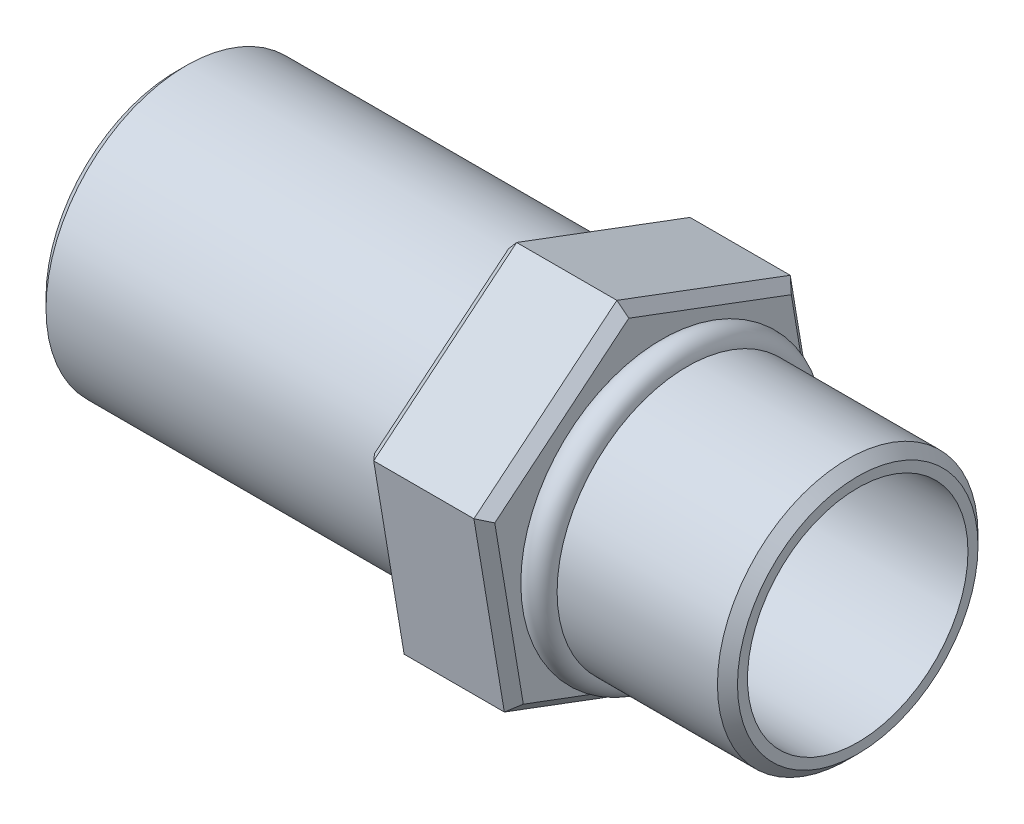
ISO-10303-21;
HEADER;
FILE_DESCRIPTION(('STEP AP214'),'2;1');
FILE_NAME('part.step','',(''),(''),'','','');
FILE_SCHEMA(('AUTOMOTIVE_DESIGN { 1 0 10303 214 1 1 1 1 }'));
ENDSEC;
DATA;
#1=APPLICATION_CONTEXT('core data for automotive mechanical design processes');
#2=APPLICATION_PROTOCOL_DEFINITION('international standard','automotive_design',2000,#1);
#3=PRODUCT_CONTEXT('',#1,'mechanical');
#4=PRODUCT('Part','Part','',(#3));
#5=PRODUCT_RELATED_PRODUCT_CATEGORY('part','',(#4));
#6=PRODUCT_DEFINITION_FORMATION('','',#4);
#7=PRODUCT_DEFINITION_CONTEXT('part definition',#1,'design');
#8=PRODUCT_DEFINITION('design','',#6,#7);
#9=PRODUCT_DEFINITION_SHAPE('','',#8);
#10=(LENGTH_UNIT() NAMED_UNIT(*) SI_UNIT(.MILLI.,.METRE.));
#11=(NAMED_UNIT(*) PLANE_ANGLE_UNIT() SI_UNIT($,.RADIAN.));
#12=(NAMED_UNIT(*) SI_UNIT($,.STERADIAN.) SOLID_ANGLE_UNIT());
#13=UNCERTAINTY_MEASURE_WITH_UNIT(LENGTH_MEASURE(1.E-05),#10,'distance_accuracy_value','');
#14=(GEOMETRIC_REPRESENTATION_CONTEXT(3) GLOBAL_UNCERTAINTY_ASSIGNED_CONTEXT((#13)) GLOBAL_UNIT_ASSIGNED_CONTEXT((#10,
#11,#12)) REPRESENTATION_CONTEXT('',''));
#15=CARTESIAN_POINT('',(0.,0.,0.));
#16=DIRECTION('',(0.,0.,1.));
#17=DIRECTION('',(1.,0.,0.));
#18=AXIS2_PLACEMENT_3D('',#15,#16,#17);
#19=CARTESIAN_POINT('',(10.,0.,0.));
#20=DIRECTION('',(-1.,0.,0.));
#21=DIRECTION('',(0.,0.,1.));
#22=AXIS2_PLACEMENT_3D('',#19,#20,#21);
#23=CYLINDRICAL_SURFACE('',#22,6.5);
#24=CARTESIAN_POINT('',(9.49999999999999,0.,0.));
#25=DIRECTION('',(1.,0.,0.));
#26=DIRECTION('',(0.,0.,-1.));
#27=AXIS2_PLACEMENT_3D('',#24,#25,#26);
#28=CIRCLE('',#27,6.5);
#29=CARTESIAN_POINT('',(9.49999999999999,0.,-6.5));
#30=VERTEX_POINT('',#29);
#31=EDGE_CURVE('E243',#30,#30,#28,.F.);
#32=ORIENTED_EDGE('',*,*,#31,.T.);
#33=EDGE_LOOP('',(#32));
#34=FACE_BOUND('',#33,.T.);
#35=CARTESIAN_POINT('',(1.5,0.,0.));
#36=DIRECTION('',(1.,0.,0.));
#37=DIRECTION('',(0.,0.,-1.));
#38=AXIS2_PLACEMENT_3D('',#35,#36,#37);
#39=CIRCLE('',#38,6.5);
#40=CARTESIAN_POINT('',(1.5,0.,-6.5));
#41=VERTEX_POINT('',#40);
#42=EDGE_CURVE('E158',#41,#41,#39,.T.);
#43=ORIENTED_EDGE('',*,*,#42,.T.);
#44=EDGE_LOOP('',(#43));
#45=FACE_BOUND('',#44,.T.);
#46=ADVANCED_FACE('F34',(#34,#45),#23,.T.);
#47=CARTESIAN_POINT('',(10.,0.,0.));
#48=DIRECTION('',(1.,0.,0.));
#49=DIRECTION('',(0.,0.,-1.));
#50=AXIS2_PLACEMENT_3D('',#47,#48,#49);
#51=PLANE('',#50);
#52=CARTESIAN_POINT('',(10.,0.,0.));
#53=DIRECTION('',(1.,0.,0.));
#54=DIRECTION('',(0.,0.,-1.));
#55=AXIS2_PLACEMENT_3D('',#52,#53,#54);
#56=CIRCLE('',#55,5.99999999999999);
#57=CARTESIAN_POINT('',(10.,0.,-5.99999999999999));
#58=VERTEX_POINT('',#57);
#59=EDGE_CURVE('E219',#58,#58,#56,.T.);
#60=ORIENTED_EDGE('',*,*,#59,.T.);
#61=EDGE_LOOP('',(#60));
#62=FACE_BOUND('',#61,.T.);
#63=CARTESIAN_POINT('',(10.,0.,0.));
#64=DIRECTION('',(1.,0.,0.));
#65=DIRECTION('',(0.,0.,-1.));
#66=AXIS2_PLACEMENT_3D('',#63,#64,#65);
#67=CIRCLE('',#66,5.5);
#68=CARTESIAN_POINT('',(10.,0.,-5.5));
#69=VERTEX_POINT('',#68);
#70=EDGE_CURVE('E240',#69,#69,#67,.T.);
#71=ORIENTED_EDGE('',*,*,#70,.F.);
#72=EDGE_LOOP('',(#71));
#73=FACE_BOUND('',#72,.T.);
#74=ADVANCED_FACE('F283',(#62,#73),#51,.T.);
#75=CARTESIAN_POINT('',(0.75,0.,0.));
#76=DIRECTION('',(1.,0.,0.));
#77=DIRECTION('',(0.,0.,-1.));
#78=AXIS2_PLACEMENT_3D('',#75,#76,#77);
#79=TOROIDAL_SURFACE('',#78,6.5,0.75);
#80=CARTESIAN_POINT('',(0.,0.,0.));
#81=DIRECTION('',(1.,0.,0.));
#82=DIRECTION('',(0.,0.,-1.));
#83=AXIS2_PLACEMENT_3D('',#80,#81,#82);
#84=CIRCLE('',#83,6.5);
#85=CARTESIAN_POINT('',(0.,0.,-6.5));
#86=VERTEX_POINT('',#85);
#87=EDGE_CURVE('E161',#86,#86,#84,.F.);
#88=ORIENTED_EDGE('',*,*,#87,.F.);
#89=EDGE_LOOP('',(#88));
#90=FACE_BOUND('',#89,.T.);
#91=ORIENTED_EDGE('',*,*,#42,.F.);
#92=EDGE_LOOP('',(#91));
#93=FACE_BOUND('',#92,.T.);
#94=ADVANCED_FACE('F289',(#90,#93),#79,.T.);
#95=CARTESIAN_POINT('',(-6.,-9.11201705266674,-1.51805090996447));
#96=DIRECTION('',(0.,0.936418514454213,-0.350885117648731));
#97=DIRECTION('',(0.,0.350885117648731,0.936418514454214));
#98=AXIS2_PLACEMENT_3D('',#95,#96,#97);
#99=PLANE('',#98);
#100=DIRECTION('',(1.,0.,0.));
#101=VECTOR('',#100,1.);
#102=CARTESIAN_POINT('',(-6.,-9.11201705266674,-1.51805090996447));
#103=LINE('',#102,#101);
#104=CARTESIAN_POINT('',(-5.5,-9.11201705266674,-1.51805090996447));
#105=VERTEX_POINT('',#104);
#106=CARTESIAN_POINT('',(-0.499999999999997,-9.11201705266674,-1.51805090996447));
#107=VERTEX_POINT('',#106);
#108=EDGE_CURVE('E195',#105,#107,#103,.T.);
#109=ORIENTED_EDGE('',*,*,#108,.T.);
#110=DIRECTION('',(0.,0.350885117648731,0.936418514454214));
#111=VECTOR('',#110,1.);
#112=CARTESIAN_POINT('',(-0.499999999999997,-9.11201705266674,-1.51805090996447));
#113=LINE('',#112,#111);
#114=CARTESIAN_POINT('',(-0.499999999999997,-5.87067917860069,7.13221279234417));
#115=VERTEX_POINT('',#114);
#116=EDGE_CURVE('E215',#107,#115,#113,.T.);
#117=ORIENTED_EDGE('',*,*,#116,.T.);
#118=DIRECTION('',(1.,0.,0.));
#119=VECTOR('',#118,1.);
#120=CARTESIAN_POINT('',(-6.,-5.87067917860069,7.13221279234417));
#121=LINE('',#120,#119);
#122=CARTESIAN_POINT('',(-5.5,-5.87067917860069,7.13221279234417));
#123=VERTEX_POINT('',#122);
#124=EDGE_CURVE('E374',#123,#115,#121,.T.);
#125=ORIENTED_EDGE('',*,*,#124,.F.);
#126=DIRECTION('',(0.,-0.350885117648731,-0.936418514454214));
#127=VECTOR('',#126,1.);
#128=CARTESIAN_POINT('',(-5.5,-9.11201705266674,-1.51805090996447));
#129=LINE('',#128,#127);
#130=EDGE_CURVE('E182',#123,#105,#129,.T.);
#131=ORIENTED_EDGE('',*,*,#130,.T.);
#132=EDGE_LOOP('',(#109,#117,#125,#131));
#133=FACE_BOUND('',#132,.T.);
#134=ADVANCED_FACE('F383',(#133),#99,.F.);
#135=CARTESIAN_POINT('',(-6.,-5.87067917860069,7.13221279234417));
#136=DIRECTION('',(0.,0.164333831533414,-0.9864047809158));
#137=DIRECTION('',(0.,0.9864047809158,0.164333831533414));
#138=AXIS2_PLACEMENT_3D('',#135,#136,#137);
#139=PLANE('',#138);
#140=ORIENTED_EDGE('',*,*,#124,.T.);
#141=DIRECTION('',(0.,0.9864047809158,0.164333831533414));
#142=VECTOR('',#141,1.);
#143=CARTESIAN_POINT('',(-0.499999999999997,-5.87067917860069,7.13221279234417));
#144=LINE('',#143,#142);
#145=CARTESIAN_POINT('',(-0.499999999999997,3.24133787406605,8.65026370230864));
#146=VERTEX_POINT('',#145);
#147=EDGE_CURVE('E213',#115,#146,#144,.T.);
#148=ORIENTED_EDGE('',*,*,#147,.T.);
#149=DIRECTION('',(1.,0.,0.));
#150=VECTOR('',#149,1.);
#151=CARTESIAN_POINT('',(-6.,3.24133787406605,8.65026370230864));
#152=LINE('',#151,#150);
#153=CARTESIAN_POINT('',(-5.5,3.24133787406605,8.65026370230864));
#154=VERTEX_POINT('',#153);
#155=EDGE_CURVE('E371',#154,#146,#152,.T.);
#156=ORIENTED_EDGE('',*,*,#155,.F.);
#157=DIRECTION('',(0.,-0.9864047809158,-0.164333831533414));
#158=VECTOR('',#157,1.);
#159=CARTESIAN_POINT('',(-5.5,-5.87067917860069,7.13221279234417));
#160=LINE('',#159,#158);
#161=EDGE_CURVE('E172',#154,#123,#160,.T.);
#162=ORIENTED_EDGE('',*,*,#161,.T.);
#163=EDGE_LOOP('',(#140,#148,#156,#162));
#164=FACE_BOUND('',#163,.T.);
#165=ADVANCED_FACE('F388',(#164),#139,.F.);
#166=CARTESIAN_POINT('',(-6.,3.24133787406605,8.65026370230864));
#167=DIRECTION('',(0.,-0.772084682920799,-0.635519663267069));
#168=DIRECTION('',(0.,0.635519663267069,-0.772084682920799));
#169=AXIS2_PLACEMENT_3D('',#166,#167,#168);
#170=PLANE('',#169);
#171=ORIENTED_EDGE('',*,*,#155,.T.);
#172=DIRECTION('',(0.,0.635519663267069,-0.772084682920799));
#173=VECTOR('',#172,1.);
#174=CARTESIAN_POINT('',(-0.499999999999997,3.24133787406605,8.65026370230864));
#175=LINE('',#174,#173);
#176=CARTESIAN_POINT('',(-0.499999999999997,9.11201705266674,1.51805090996447));
#177=VERTEX_POINT('',#176);
#178=EDGE_CURVE('E211',#146,#177,#175,.T.);
#179=ORIENTED_EDGE('',*,*,#178,.T.);
#180=DIRECTION('',(1.,0.,0.));
#181=VECTOR('',#180,1.);
#182=CARTESIAN_POINT('',(-6.,9.11201705266674,1.51805090996447));
#183=LINE('',#182,#181);
#184=CARTESIAN_POINT('',(-5.5,9.11201705266674,1.51805090996447));
#185=VERTEX_POINT('',#184);
#186=EDGE_CURVE('E368',#185,#177,#183,.T.);
#187=ORIENTED_EDGE('',*,*,#186,.F.);
#188=DIRECTION('',(0.,-0.635519663267069,0.772084682920799));
#189=VECTOR('',#188,1.);
#190=CARTESIAN_POINT('',(-5.5,3.24133787406605,8.65026370230864));
#191=LINE('',#190,#189);
#192=EDGE_CURVE('E175',#185,#154,#191,.T.);
#193=ORIENTED_EDGE('',*,*,#192,.T.);
#194=EDGE_LOOP('',(#171,#179,#187,#193));
#195=FACE_BOUND('',#194,.T.);
#196=ADVANCED_FACE('F394',(#195),#170,.F.);
#197=CARTESIAN_POINT('',(-6.,9.11201705266674,1.51805090996447));
#198=DIRECTION('',(0.,-0.936418514454214,0.350885117648731));
#199=DIRECTION('',(0.,-0.350885117648731,-0.936418514454214));
#200=AXIS2_PLACEMENT_3D('',#197,#198,#199);
#201=PLANE('',#200);
#202=ORIENTED_EDGE('',*,*,#186,.T.);
#203=DIRECTION('',(0.,-0.350885117648731,-0.936418514454214));
#204=VECTOR('',#203,1.);
#205=CARTESIAN_POINT('',(-0.499999999999997,9.11201705266674,1.51805090996447));
#206=LINE('',#205,#204);
#207=CARTESIAN_POINT('',(-0.499999999999997,5.87067917860068,-7.13221279234416));
#208=VERTEX_POINT('',#207);
#209=EDGE_CURVE('E184',#177,#208,#206,.T.);
#210=ORIENTED_EDGE('',*,*,#209,.T.);
#211=DIRECTION('',(1.,0.,0.));
#212=VECTOR('',#211,1.);
#213=CARTESIAN_POINT('',(-6.,5.87067917860068,-7.13221279234416));
#214=LINE('',#213,#212);
#215=CARTESIAN_POINT('',(-5.5,5.87067917860068,-7.13221279234416));
#216=VERTEX_POINT('',#215);
#217=EDGE_CURVE('E366',#216,#208,#214,.T.);
#218=ORIENTED_EDGE('',*,*,#217,.F.);
#219=DIRECTION('',(0.,0.350885117648731,0.936418514454214));
#220=VECTOR('',#219,1.);
#221=CARTESIAN_POINT('',(-5.5,9.11201705266674,1.51805090996447));
#222=LINE('',#221,#220);
#223=EDGE_CURVE('E177',#216,#185,#222,.T.);
#224=ORIENTED_EDGE('',*,*,#223,.T.);
#225=EDGE_LOOP('',(#202,#210,#218,#224));
#226=FACE_BOUND('',#225,.T.);
#227=ADVANCED_FACE('F398',(#226),#201,.F.);
#228=CARTESIAN_POINT('',(-6.,5.87067917860068,-7.13221279234416));
#229=DIRECTION('',(0.,-0.164333831533414,0.9864047809158));
#230=DIRECTION('',(0.,-0.9864047809158,-0.164333831533414));
#231=AXIS2_PLACEMENT_3D('',#228,#229,#230);
#232=PLANE('',#231);
#233=ORIENTED_EDGE('',*,*,#217,.T.);
#234=DIRECTION('',(0.,-0.9864047809158,-0.164333831533414));
#235=VECTOR('',#234,1.);
#236=CARTESIAN_POINT('',(-0.499999999999997,5.87067917860068,-7.13221279234416));
#237=LINE('',#236,#235);
#238=CARTESIAN_POINT('',(-0.499999999999997,-3.24133787406605,-8.65026370230864));
#239=VERTEX_POINT('',#238);
#240=EDGE_CURVE('E56',#208,#239,#237,.T.);
#241=ORIENTED_EDGE('',*,*,#240,.T.);
#242=DIRECTION('',(1.,0.,0.));
#243=VECTOR('',#242,1.);
#244=CARTESIAN_POINT('',(-6.,-3.24133787406605,-8.65026370230864));
#245=LINE('',#244,#243);
#246=CARTESIAN_POINT('',(-5.5,-3.24133787406605,-8.65026370230864));
#247=VERTEX_POINT('',#246);
#248=EDGE_CURVE('E364',#247,#239,#245,.T.);
#249=ORIENTED_EDGE('',*,*,#248,.F.);
#250=DIRECTION('',(0.,0.9864047809158,0.164333831533414));
#251=VECTOR('',#250,1.);
#252=CARTESIAN_POINT('',(-5.5,5.87067917860068,-7.13221279234416));
#253=LINE('',#252,#251);
#254=EDGE_CURVE('E179',#247,#216,#253,.T.);
#255=ORIENTED_EDGE('',*,*,#254,.T.);
#256=EDGE_LOOP('',(#233,#241,#249,#255));
#257=FACE_BOUND('',#256,.T.);
#258=ADVANCED_FACE('F402',(#257),#232,.F.);
#259=CARTESIAN_POINT('',(-6.,-3.24133787406605,-8.65026370230864));
#260=DIRECTION('',(0.,0.772084682920799,0.635519663267069));
#261=DIRECTION('',(0.,-0.635519663267069,0.772084682920799));
#262=AXIS2_PLACEMENT_3D('',#259,#260,#261);
#263=PLANE('',#262);
#264=ORIENTED_EDGE('',*,*,#248,.T.);
#265=DIRECTION('',(0.,-0.635519663267069,0.772084682920799));
#266=VECTOR('',#265,1.);
#267=CARTESIAN_POINT('',(-0.499999999999997,-3.24133787406605,-8.65026370230864));
#268=LINE('',#267,#266);
#269=EDGE_CURVE('E63',#239,#107,#268,.T.);
#270=ORIENTED_EDGE('',*,*,#269,.T.);
#271=ORIENTED_EDGE('',*,*,#108,.F.);
#272=DIRECTION('',(0.,0.635519663267069,-0.772084682920799));
#273=VECTOR('',#272,1.);
#274=CARTESIAN_POINT('',(-5.5,-3.24133787406605,-8.65026370230864));
#275=LINE('',#274,#273);
#276=EDGE_CURVE('E149',#105,#247,#275,.T.);
#277=ORIENTED_EDGE('',*,*,#276,.T.);
#278=EDGE_LOOP('',(#264,#270,#271,#277));
#279=FACE_BOUND('',#278,.T.);
#280=ADVANCED_FACE('F406',(#279),#263,.F.);
#281=CARTESIAN_POINT('',(-6.,0.,0.));
#282=DIRECTION('',(-1.,0.,0.));
#283=DIRECTION('',(0.,0.,1.));
#284=AXIS2_PLACEMENT_3D('',#281,#282,#283);
#285=PLANE('',#284);
#286=CARTESIAN_POINT('',(-6.,0.,0.));
#287=DIRECTION('',(-1.,0.,0.));
#288=DIRECTION('',(0.,0.,1.));
#289=AXIS2_PLACEMENT_3D('',#286,#287,#288);
#290=CIRCLE('',#289,7.1);
#291=CARTESIAN_POINT('',(-6.,0.,7.1));
#292=VERTEX_POINT('',#291);
#293=EDGE_CURVE('E11',#292,#292,#290,.F.);
#294=ORIENTED_EDGE('',*,*,#293,.T.);
#295=EDGE_LOOP('',(#294));
#296=FACE_BOUND('',#295,.T.);
#297=DIRECTION('',(0.,0.350885117648731,0.936418514454214));
#298=VECTOR('',#297,1.);
#299=CARTESIAN_POINT('',(-6.,-5.40246992137358,6.9567702335198));
#300=LINE('',#299,#298);
#301=CARTESIAN_POINT('',(-6.,-8.54251598687507,-1.42317272809169));
#302=VERTEX_POINT('',#301);
#303=CARTESIAN_POINT('',(-6.,-5.50376172993814,6.68644949282266));
#304=VERTEX_POINT('',#303);
#305=EDGE_CURVE('E137',#302,#304,#300,.T.);
#306=ORIENTED_EDGE('',*,*,#305,.T.);
#307=DIRECTION('',(0.,0.9864047809158,0.164333831533414));
#308=VECTOR('',#307,1.);
#309=CARTESIAN_POINT('',(-6.,3.32350478983276,8.15706131185074));
#310=LINE('',#309,#308);
#311=CARTESIAN_POINT('',(-6.,3.03875425693693,8.10962222091435));
#312=VERTEX_POINT('',#311);
#313=EDGE_CURVE('E170',#304,#312,#310,.T.);
#314=ORIENTED_EDGE('',*,*,#313,.T.);
#315=DIRECTION('',(0.,0.635519663267069,-0.772084682920799));
#316=VECTOR('',#315,1.);
#317=CARTESIAN_POINT('',(-6.,8.72597471120634,1.20029107833094));
#318=LINE('',#317,#316);
#319=CARTESIAN_POINT('',(-6.,8.54251598687507,1.42317272809169));
#320=VERTEX_POINT('',#319);
#321=EDGE_CURVE('E168',#312,#320,#318,.T.);
#322=ORIENTED_EDGE('',*,*,#321,.T.);
#323=DIRECTION('',(0.,-0.350885117648731,-0.936418514454214));
#324=VECTOR('',#323,1.);
#325=CARTESIAN_POINT('',(-6.,5.40246992137358,-6.9567702335198));
#326=LINE('',#325,#324);
#327=CARTESIAN_POINT('',(-6.,5.50376172993814,-6.68644949282266));
#328=VERTEX_POINT('',#327);
#329=EDGE_CURVE('E166',#320,#328,#326,.T.);
#330=ORIENTED_EDGE('',*,*,#329,.T.);
#331=DIRECTION('',(0.,-0.9864047809158,-0.164333831533414));
#332=VECTOR('',#331,1.);
#333=CARTESIAN_POINT('',(-6.,-3.32350478983276,-8.15706131185073));
#334=LINE('',#333,#332);
#335=CARTESIAN_POINT('',(-6.,-3.03875425693693,-8.10962222091434));
#336=VERTEX_POINT('',#335);
#337=EDGE_CURVE('E140',#328,#336,#334,.T.);
#338=ORIENTED_EDGE('',*,*,#337,.T.);
#339=DIRECTION('',(0.,-0.635519663267069,0.772084682920799));
#340=VECTOR('',#339,1.);
#341=CARTESIAN_POINT('',(-6.,-8.72597471120634,-1.20029107833093));
#342=LINE('',#341,#340);
#343=EDGE_CURVE('E132',#336,#302,#342,.T.);
#344=ORIENTED_EDGE('',*,*,#343,.T.);
#345=EDGE_LOOP('',(#306,#314,#322,#330,#338,#344));
#346=FACE_BOUND('',#345,.T.);
#347=ADVANCED_FACE('F134',(#296,#346),#285,.T.);
#348=CARTESIAN_POINT('',(0.,0.,0.));
#349=DIRECTION('',(-1.,0.,0.));
#350=DIRECTION('',(0.,0.,1.));
#351=AXIS2_PLACEMENT_3D('',#348,#349,#350);
#352=PLANE('',#351);
#353=DIRECTION('',(0.,0.9864047809158,0.164333831533414));
#354=VECTOR('',#353,1.);
#355=CARTESIAN_POINT('',(0.,1.23250373650061,-7.39803585686849));
#356=LINE('',#355,#354);
#357=CARTESIAN_POINT('',(0.,-3.03875425693692,-8.10962222091434));
#358=VERTEX_POINT('',#357);
#359=CARTESIAN_POINT('',(0.,5.50376172993814,-6.68644949282265));
#360=VERTEX_POINT('',#359);
#361=EDGE_CURVE('E198',#358,#360,#356,.T.);
#362=ORIENTED_EDGE('',*,*,#361,.T.);
#363=DIRECTION('',(0.,0.350885117648731,0.936418514454214));
#364=VECTOR('',#363,1.);
#365=CARTESIAN_POINT('',(0.,7.0231388584066,-2.63163838236548));
#366=LINE('',#365,#364);
#367=CARTESIAN_POINT('',(0.,8.54251598687506,1.42317272809169));
#368=VERTEX_POINT('',#367);
#369=EDGE_CURVE('E208',#360,#368,#366,.T.);
#370=ORIENTED_EDGE('',*,*,#369,.T.);
#371=DIRECTION('',(0.,-0.635519663267069,0.772084682920799));
#372=VECTOR('',#371,1.);
#373=CARTESIAN_POINT('',(0.,5.79063512190599,4.76639747450302));
#374=LINE('',#373,#372);
#375=CARTESIAN_POINT('',(0.,3.03875425693692,8.10962222091434));
#376=VERTEX_POINT('',#375);
#377=EDGE_CURVE('E206',#368,#376,#374,.T.);
#378=ORIENTED_EDGE('',*,*,#377,.T.);
#379=DIRECTION('',(0.,-0.9864047809158,-0.164333831533414));
#380=VECTOR('',#379,1.);
#381=CARTESIAN_POINT('',(0.,-1.23250373650061,7.3980358568685));
#382=LINE('',#381,#380);
#383=CARTESIAN_POINT('',(0.,-5.50376172993814,6.68644949282265));
#384=VERTEX_POINT('',#383);
#385=EDGE_CURVE('E204',#376,#384,#382,.T.);
#386=ORIENTED_EDGE('',*,*,#385,.T.);
#387=DIRECTION('',(0.,-0.350885117648731,-0.936418514454214));
#388=VECTOR('',#387,1.);
#389=CARTESIAN_POINT('',(0.,-7.0231388584066,2.63163838236548));
#390=LINE('',#389,#388);
#391=CARTESIAN_POINT('',(0.,-8.54251598687507,-1.42317272809169));
#392=VERTEX_POINT('',#391);
#393=EDGE_CURVE('E202',#384,#392,#390,.T.);
#394=ORIENTED_EDGE('',*,*,#393,.T.);
#395=DIRECTION('',(0.,0.635519663267069,-0.772084682920799));
#396=VECTOR('',#395,1.);
#397=CARTESIAN_POINT('',(0.,-5.79063512190599,-4.76639747450302));
#398=LINE('',#397,#396);
#399=EDGE_CURVE('E200',#392,#358,#398,.T.);
#400=ORIENTED_EDGE('',*,*,#399,.T.);
#401=EDGE_LOOP('',(#362,#370,#378,#386,#394,#400));
#402=FACE_BOUND('',#401,.T.);
#403=ORIENTED_EDGE('',*,*,#87,.T.);
#404=EDGE_LOOP('',(#403));
#405=FACE_BOUND('',#404,.T.);
#406=ADVANCED_FACE('F379',(#402,#405),#352,.F.);
#407=CARTESIAN_POINT('',(-24.,0.,0.));
#408=DIRECTION('',(1.,0.,0.));
#409=DIRECTION('',(0.,0.,-1.));
#410=AXIS2_PLACEMENT_3D('',#407,#408,#409);
#411=CYLINDRICAL_SURFACE('',#410,7.);
#412=CARTESIAN_POINT('',(-6.1,0.,0.));
#413=DIRECTION('',(-1.,0.,0.));
#414=DIRECTION('',(0.,0.,1.));
#415=AXIS2_PLACEMENT_3D('',#412,#413,#414);
#416=CIRCLE('',#415,7.);
#417=CARTESIAN_POINT('',(-6.1,0.,7.));
#418=VERTEX_POINT('',#417);
#419=EDGE_CURVE('E48',#418,#418,#416,.T.);
#420=ORIENTED_EDGE('',*,*,#419,.T.);
#421=EDGE_LOOP('',(#420));
#422=FACE_BOUND('',#421,.T.);
#423=CARTESIAN_POINT('',(-23.5,0.,0.));
#424=DIRECTION('',(-1.,0.,0.));
#425=DIRECTION('',(0.,0.,1.));
#426=AXIS2_PLACEMENT_3D('',#423,#424,#425);
#427=CIRCLE('',#426,7.);
#428=CARTESIAN_POINT('',(-23.5,0.,7.));
#429=VERTEX_POINT('',#428);
#430=EDGE_CURVE('E249',#429,#429,#427,.F.);
#431=ORIENTED_EDGE('',*,*,#430,.T.);
#432=EDGE_LOOP('',(#431));
#433=FACE_BOUND('',#432,.T.);
#434=ADVANCED_FACE('F354',(#422,#433),#411,.T.);
#435=CARTESIAN_POINT('',(-24.,0.,0.));
#436=DIRECTION('',(-1.,0.,0.));
#437=DIRECTION('',(0.,0.,1.));
#438=AXIS2_PLACEMENT_3D('',#435,#436,#437);
#439=PLANE('',#438);
#440=CARTESIAN_POINT('',(-24.,0.,0.));
#441=DIRECTION('',(-1.,0.,0.));
#442=DIRECTION('',(0.,0.,1.));
#443=AXIS2_PLACEMENT_3D('',#440,#441,#442);
#444=CIRCLE('',#443,6.49999999999999);
#445=CARTESIAN_POINT('',(-24.,0.,6.49999999999999));
#446=VERTEX_POINT('',#445);
#447=EDGE_CURVE('E246',#446,#446,#444,.T.);
#448=ORIENTED_EDGE('',*,*,#447,.T.);
#449=EDGE_LOOP('',(#448));
#450=FACE_BOUND('',#449,.T.);
#451=CARTESIAN_POINT('',(-24.,0.,0.));
#452=DIRECTION('',(-1.,0.,0.));
#453=DIRECTION('',(0.,0.,1.));
#454=AXIS2_PLACEMENT_3D('',#451,#452,#453);
#455=CIRCLE('',#454,5.75);
#456=CARTESIAN_POINT('',(-24.,0.,5.75));
#457=VERTEX_POINT('',#456);
#458=EDGE_CURVE('E239',#457,#457,#455,.T.);
#459=ORIENTED_EDGE('',*,*,#458,.F.);
#460=EDGE_LOOP('',(#459));
#461=FACE_BOUND('',#460,.T.);
#462=ADVANCED_FACE('F315',(#450,#461),#439,.T.);
#463=CARTESIAN_POINT('',(-6.,1.23250373650061,-7.3980358568685));
#464=DIRECTION('',(-0.707106781186547,0.116201566655645,-0.697493509580393));
#465=DIRECTION('',(0.,0.9864047809158,0.164333831533414));
#466=AXIS2_PLACEMENT_3D('',#463,#464,#465);
#467=PLANE('',#466);
#468=DIRECTION('',(0.654653670707978,0.480407709227477,-0.583641160597313));
#469=VECTOR('',#468,1.);
#470=CARTESIAN_POINT('',(-7.07142857142857,4.7175100542327,-5.73124242241942));
#471=LINE('',#470,#469);
#472=EDGE_CURVE('E152',#216,#328,#471,.F.);
#473=ORIENTED_EDGE('',*,*,#472,.F.);
#474=ORIENTED_EDGE('',*,*,#254,.F.);
#475=DIRECTION('',(0.654653670707978,-0.265244217157764,-0.70786586066354));
#476=VECTOR('',#475,1.);
#477=CARTESIAN_POINT('',(-7.07142857142858,-2.60464650594594,-6.95110476078372));
#478=LINE('',#477,#476);
#479=EDGE_CURVE('E193',#336,#247,#478,.T.);
#480=ORIENTED_EDGE('',*,*,#479,.F.);
#481=ORIENTED_EDGE('',*,*,#337,.F.);
#482=EDGE_LOOP('',(#473,#474,#480,#481));
#483=FACE_BOUND('',#482,.T.);
#484=ADVANCED_FACE('F312',(#483),#467,.T.);
#485=CARTESIAN_POINT('',(-6.,-5.79063512190599,-4.76639747450302));
#486=DIRECTION('',(-0.707106781186546,-0.545946314943564,-0.449380263473537));
#487=DIRECTION('',(0.,0.635519663267069,-0.772084682920799));
#488=AXIS2_PLACEMENT_3D('',#485,#486,#487);
#489=PLANE('',#488);
#490=ORIENTED_EDGE('',*,*,#479,.T.);
#491=ORIENTED_EDGE('',*,*,#276,.F.);
#492=DIRECTION('',(0.654653670707979,-0.745651926385244,-0.124224700066228));
#493=VECTOR('',#492,1.);
#494=CARTESIAN_POINT('',(-7.07142857142857,-7.32215656017864,-1.2198623383643));
#495=LINE('',#494,#493);
#496=EDGE_CURVE('E147',#302,#105,#495,.T.);
#497=ORIENTED_EDGE('',*,*,#496,.F.);
#498=ORIENTED_EDGE('',*,*,#343,.F.);
#499=EDGE_LOOP('',(#490,#491,#497,#498));
#500=FACE_BOUND('',#499,.T.);
#501=ADVANCED_FACE('F148',(#500),#489,.T.);
#502=CARTESIAN_POINT('',(-6.,7.0231388584066,-2.63163838236548));
#503=DIRECTION('',(-0.707106781186546,0.662147881599209,-0.248113246106858));
#504=DIRECTION('',(0.,0.350885117648731,0.936418514454214));
#505=AXIS2_PLACEMENT_3D('',#502,#503,#504);
#506=PLANE('',#505);
#507=ORIENTED_EDGE('',*,*,#472,.T.);
#508=ORIENTED_EDGE('',*,*,#329,.F.);
#509=DIRECTION('',(0.654653670707979,0.745651926385244,0.124224700066227));
#510=VECTOR('',#509,1.);
#511=CARTESIAN_POINT('',(-7.07142857142857,7.32215656017863,1.21986233836431));
#512=LINE('',#511,#510);
#513=EDGE_CURVE('E153',#185,#320,#512,.F.);
#514=ORIENTED_EDGE('',*,*,#513,.F.);
#515=ORIENTED_EDGE('',*,*,#223,.F.);
#516=EDGE_LOOP('',(#507,#508,#514,#515));
#517=FACE_BOUND('',#516,.T.);
#518=ADVANCED_FACE('F306',(#517),#506,.T.);
#519=CARTESIAN_POINT('',(-6.,-7.02313885840661,2.63163838236548));
#520=DIRECTION('',(-0.707106781186546,-0.662147881599209,0.248113246106858));
#521=DIRECTION('',(0.,-0.350885117648731,-0.936418514454214));
#522=AXIS2_PLACEMENT_3D('',#519,#520,#521);
#523=PLANE('',#522);
#524=ORIENTED_EDGE('',*,*,#496,.T.);
#525=ORIENTED_EDGE('',*,*,#130,.F.);
#526=DIRECTION('',(-0.654653670707979,0.480407709227478,-0.583641160597311));
#527=VECTOR('',#526,1.);
#528=CARTESIAN_POINT('',(-7.07142857142857,-4.7175100542327,5.73124242241943));
#529=LINE('',#528,#527);
#530=EDGE_CURVE('E156',#304,#123,#529,.F.);
#531=ORIENTED_EDGE('',*,*,#530,.F.);
#532=ORIENTED_EDGE('',*,*,#305,.F.);
#533=EDGE_LOOP('',(#524,#525,#531,#532));
#534=FACE_BOUND('',#533,.T.);
#535=ADVANCED_FACE('F155',(#534),#523,.T.);
#536=CARTESIAN_POINT('',(-6.,5.790635121906,4.76639747450302));
#537=DIRECTION('',(-0.707106781186546,0.545946314943564,0.449380263473537));
#538=DIRECTION('',(0.,-0.635519663267069,0.772084682920799));
#539=AXIS2_PLACEMENT_3D('',#536,#537,#538);
#540=PLANE('',#539);
#541=ORIENTED_EDGE('',*,*,#513,.T.);
#542=ORIENTED_EDGE('',*,*,#321,.F.);
#543=DIRECTION('',(0.654653670707979,0.265244217157766,0.707865860663539));
#544=VECTOR('',#543,1.);
#545=CARTESIAN_POINT('',(-7.07142857142857,2.60464650594594,6.95110476078373));
#546=LINE('',#545,#544);
#547=EDGE_CURVE('E185',#154,#312,#546,.F.);
#548=ORIENTED_EDGE('',*,*,#547,.F.);
#549=ORIENTED_EDGE('',*,*,#192,.F.);
#550=EDGE_LOOP('',(#541,#542,#548,#549));
#551=FACE_BOUND('',#550,.T.);
#552=ADVANCED_FACE('F299',(#551),#540,.T.);
#553=CARTESIAN_POINT('',(-6.,-1.23250373650061,7.3980358568685));
#554=DIRECTION('',(-0.707106781186546,-0.116201566655645,0.697493509580395));
#555=DIRECTION('',(0.,-0.9864047809158,-0.164333831533414));
#556=AXIS2_PLACEMENT_3D('',#553,#554,#555);
#557=PLANE('',#556);
#558=ORIENTED_EDGE('',*,*,#530,.T.);
#559=ORIENTED_EDGE('',*,*,#161,.F.);
#560=ORIENTED_EDGE('',*,*,#547,.T.);
#561=ORIENTED_EDGE('',*,*,#313,.F.);
#562=EDGE_LOOP('',(#558,#559,#560,#561));
#563=FACE_BOUND('',#562,.T.);
#564=ADVANCED_FACE('F295',(#563),#557,.T.);
#565=CARTESIAN_POINT('',(-0.499999999999997,-9.11201705266674,-1.51805090996447));
#566=DIRECTION('',(-0.707106781186552,0.662147881599203,-0.248113246106856));
#567=DIRECTION('',(0.,0.350885117648731,0.936418514454214));
#568=AXIS2_PLACEMENT_3D('',#565,#566,#567);
#569=PLANE('',#568);
#570=DIRECTION('',(-0.654653670707972,-0.745651926385249,-0.124224700066229));
#571=VECTOR('',#570,1.);
#572=CARTESIAN_POINT('',(1.78571428571429,-6.50858360904764,-1.08432207854604));
#573=LINE('',#572,#571);
#574=EDGE_CURVE('E231',#392,#107,#573,.T.);
#575=ORIENTED_EDGE('',*,*,#574,.F.);
#576=ORIENTED_EDGE('',*,*,#393,.F.);
#577=DIRECTION('',(-0.654653670707973,-0.480407709227482,0.583641160597315));
#578=VECTOR('',#577,1.);
#579=CARTESIAN_POINT('',(1.78571428571428,-4.19334227042905,5.09443770881725));
#580=LINE('',#579,#578);
#581=EDGE_CURVE('E187',#115,#384,#580,.F.);
#582=ORIENTED_EDGE('',*,*,#581,.F.);
#583=ORIENTED_EDGE('',*,*,#116,.F.);
#584=EDGE_LOOP('',(#575,#576,#582,#583));
#585=FACE_BOUND('',#584,.T.);
#586=ADVANCED_FACE('F298',(#585),#569,.F.);
#587=CARTESIAN_POINT('',(-0.499999999999997,-5.87067917860069,7.13221279234417));
#588=DIRECTION('',(-0.707106781186552,0.116201566655644,-0.697493509580389));
#589=DIRECTION('',(0.,0.9864047809158,0.164333831533414));
#590=AXIS2_PLACEMENT_3D('',#587,#588,#589);
#591=PLANE('',#590);
#592=ORIENTED_EDGE('',*,*,#581,.T.);
#593=ORIENTED_EDGE('',*,*,#385,.F.);
#594=DIRECTION('',(-0.654653670707973,0.265244217157768,0.707865860663544));
#595=VECTOR('',#594,1.);
#596=CARTESIAN_POINT('',(1.78571428571429,2.3152413386186,6.17875978736329));
#597=LINE('',#596,#595);
#598=EDGE_CURVE('E228',#146,#376,#597,.F.);
#599=ORIENTED_EDGE('',*,*,#598,.F.);
#600=ORIENTED_EDGE('',*,*,#147,.F.);
#601=EDGE_LOOP('',(#592,#593,#599,#600));
#602=FACE_BOUND('',#601,.T.);
#603=ADVANCED_FACE('F331',(#602),#591,.F.);
#604=CARTESIAN_POINT('',(-0.499999999999997,-3.24133787406605,-8.65026370230864));
#605=DIRECTION('',(-0.707106781186552,0.545946314943559,0.449380263473533));
#606=DIRECTION('',(0.,-0.635519663267069,0.772084682920799));
#607=AXIS2_PLACEMENT_3D('',#604,#605,#606);
#608=PLANE('',#607);
#609=ORIENTED_EDGE('',*,*,#574,.T.);
#610=ORIENTED_EDGE('',*,*,#269,.F.);
#611=DIRECTION('',(-0.654653670707972,-0.265244217157766,-0.707865860663546));
#612=VECTOR('',#611,1.);
#613=CARTESIAN_POINT('',(1.78571428571427,-2.31524133861861,-6.17875978736329));
#614=LINE('',#613,#612);
#615=EDGE_CURVE('E225',#358,#239,#614,.T.);
#616=ORIENTED_EDGE('',*,*,#615,.F.);
#617=ORIENTED_EDGE('',*,*,#399,.F.);
#618=EDGE_LOOP('',(#609,#610,#616,#617));
#619=FACE_BOUND('',#618,.T.);
#620=ADVANCED_FACE('F327',(#619),#608,.F.);
#621=CARTESIAN_POINT('',(-0.499999999999997,3.24133787406605,8.65026370230864));
#622=DIRECTION('',(-0.707106781186552,-0.545946314943559,-0.449380263473533));
#623=DIRECTION('',(0.,0.635519663267069,-0.772084682920799));
#624=AXIS2_PLACEMENT_3D('',#621,#622,#623);
#625=PLANE('',#624);
#626=ORIENTED_EDGE('',*,*,#598,.T.);
#627=ORIENTED_EDGE('',*,*,#377,.F.);
#628=DIRECTION('',(-0.654653670707973,0.745651926385249,0.124224700066229));
#629=VECTOR('',#628,1.);
#630=CARTESIAN_POINT('',(1.78571428571428,6.50858360904764,1.08432207854605));
#631=LINE('',#630,#629);
#632=EDGE_CURVE('E222',#177,#368,#631,.F.);
#633=ORIENTED_EDGE('',*,*,#632,.F.);
#634=ORIENTED_EDGE('',*,*,#178,.F.);
#635=EDGE_LOOP('',(#626,#627,#633,#634));
#636=FACE_BOUND('',#635,.T.);
#637=ADVANCED_FACE('F323',(#636),#625,.F.);
#638=CARTESIAN_POINT('',(-0.499999999999997,5.87067917860068,-7.13221279234416));
#639=DIRECTION('',(-0.707106781186553,-0.116201566655644,0.697493509580387));
#640=DIRECTION('',(0.,-0.9864047809158,-0.164333831533414));
#641=AXIS2_PLACEMENT_3D('',#638,#639,#640);
#642=PLANE('',#641);
#643=ORIENTED_EDGE('',*,*,#615,.T.);
#644=ORIENTED_EDGE('',*,*,#240,.F.);
#645=DIRECTION('',(0.654653670707972,-0.480407709227479,0.583641160597318));
#646=VECTOR('',#645,1.);
#647=CARTESIAN_POINT('',(-0.499999999999997,5.87067917860068,-7.13221279234416));
#648=LINE('',#647,#646);
#649=EDGE_CURVE('E220',#360,#208,#648,.F.);
#650=ORIENTED_EDGE('',*,*,#649,.F.);
#651=ORIENTED_EDGE('',*,*,#361,.F.);
#652=EDGE_LOOP('',(#643,#644,#650,#651));
#653=FACE_BOUND('',#652,.T.);
#654=ADVANCED_FACE('F319',(#653),#642,.F.);
#655=CARTESIAN_POINT('',(-0.499999999999997,9.11201705266674,1.51805090996447));
#656=DIRECTION('',(-0.707106781186552,-0.662147881599204,0.248113246106856));
#657=DIRECTION('',(0.,-0.350885117648731,-0.936418514454214));
#658=AXIS2_PLACEMENT_3D('',#655,#656,#657);
#659=PLANE('',#658);
#660=ORIENTED_EDGE('',*,*,#632,.T.);
#661=ORIENTED_EDGE('',*,*,#369,.F.);
#662=ORIENTED_EDGE('',*,*,#649,.T.);
#663=ORIENTED_EDGE('',*,*,#209,.F.);
#664=EDGE_LOOP('',(#660,#661,#662,#663));
#665=FACE_BOUND('',#664,.T.);
#666=ADVANCED_FACE('F278',(#665),#659,.F.);
#667=CARTESIAN_POINT('',(0.,0.,0.));
#668=DIRECTION('',(-1.,0.,0.));
#669=DIRECTION('',(0.,0.,1.));
#670=AXIS2_PLACEMENT_3D('',#667,#668,#669);
#671=CYLINDRICAL_SURFACE('',#670,5.75);
#672=CARTESIAN_POINT('',(-3.,-4.87819965525908,-3.04395599893136));
#673=CARTESIAN_POINT('',(-3.04193512697324,-4.87819901076158,-3.04395776544992));
#674=CARTESIAN_POINT('',(-3.08389608734036,-4.8763180249438,-3.04697790819358));
#675=CARTESIAN_POINT('',(-3.16664913809242,-4.86881453318987,-3.05895293303782));
#676=CARTESIAN_POINT('',(-3.2074399782276,-4.86318817013243,-3.06791393320362));
#677=CARTESIAN_POINT('',(-3.28664274068701,-4.84827438872773,-3.09142815581008));
#678=CARTESIAN_POINT('',(-3.32505629862009,-4.83898952063452,-3.10597748258772));
#679=CARTESIAN_POINT('',(-3.39845612803409,-4.81689304492557,-3.1401358594021));
#680=CARTESIAN_POINT('',(-3.43344296093415,-4.80408201633492,-3.15974407869324));
#681=CARTESIAN_POINT('',(-3.49921580650813,-4.77504679827824,-3.20345410710029));
#682=CARTESIAN_POINT('',(-3.52997795770077,-4.75880443918383,-3.22757975643181));
#683=CARTESIAN_POINT('',(-3.58622196083087,-4.72321916590941,-3.27943402513951));
#684=CARTESIAN_POINT('',(-3.61170354465347,-4.70387609438259,-3.30716282734548));
#685=CARTESIAN_POINT('',(-3.65674922425948,-4.66237675694682,-3.3654159490577));
#686=CARTESIAN_POINT('',(-3.67629164017435,-4.64021059377146,-3.39594999291623));
#687=CARTESIAN_POINT('',(-3.70876533332209,-4.5935959489664,-3.45874305140034));
#688=CARTESIAN_POINT('',(-3.72169687682497,-4.56914755930619,-3.49100199649323));
#689=CARTESIAN_POINT('',(-3.74051021965545,-4.51870596829467,-3.55604833151839));
#690=CARTESIAN_POINT('',(-3.74643176132181,-4.49272236113533,-3.58883166395569));
#691=CARTESIAN_POINT('',(-3.75118022465521,-4.43978058507812,-3.65412292073812));
#692=CARTESIAN_POINT('',(-3.75000744878676,-4.41282245777738,-3.68663085676553));
#693=CARTESIAN_POINT('',(-3.74063231911016,-4.35888188567561,-3.75025040936077));
#694=CARTESIAN_POINT('',(-3.73247270993891,-4.33190058334353,-3.78136930837006));
#695=CARTESIAN_POINT('',(-3.70942240963655,-4.27857946799378,-3.84159817718141));
#696=CARTESIAN_POINT('',(-3.69453158103038,-4.25223966808942,-3.87070810593927));
#697=CARTESIAN_POINT('',(-3.65839642711298,-4.2009772762603,-3.92628639920218));
#698=CARTESIAN_POINT('',(-3.63713370595225,-4.17605903979761,-3.95274681532472));
#699=CARTESIAN_POINT('',(-3.58887172877282,-4.12856486735657,-4.00232840503457));
#700=CARTESIAN_POINT('',(-3.5618721864054,-4.10598904838181,-4.02544941184122));
#701=CARTESIAN_POINT('',(-3.50266383432833,-4.06381860894889,-4.06801974055981));
#702=CARTESIAN_POINT('',(-3.47041775768675,-4.04424742136882,-4.08744046154231));
#703=CARTESIAN_POINT('',(-3.40175941842535,-4.00902030539681,-4.12199794327683));
#704=CARTESIAN_POINT('',(-3.3653471405649,-3.99336439132824,-4.13713468835669));
#705=CARTESIAN_POINT('',(-3.28935593648632,-3.96657222170964,-4.16282971627858));
#706=CARTESIAN_POINT('',(-3.24977547411177,-3.95543817476204,-4.17338576195483));
#707=CARTESIAN_POINT('',(-3.16858932712356,-3.93815503451797,-4.18969897093527));
#708=CARTESIAN_POINT('',(-3.12698374923485,-3.93200567882579,-4.19545638684127));
#709=CARTESIAN_POINT('',(-3.0432554431242,-3.92497513060431,-4.20203446196133));
#710=CARTESIAN_POINT('',(-3.00113875380309,-3.92405559420911,-4.20289105320305));
#711=CARTESIAN_POINT('',(-2.91729726379416,-3.92742031827054,-4.1997469849094));
#712=CARTESIAN_POINT('',(-2.87557245401372,-3.93170445768639,-4.19574643835412));
#713=CARTESIAN_POINT('',(-2.79385636497178,-3.94527241736357,-4.18299065736726));
#714=CARTESIAN_POINT('',(-2.75385925083672,-3.95453770831993,-4.17425304326741));
#715=CARTESIAN_POINT('',(-2.67655109003963,-3.97768220551433,-4.1522040208558));
#716=CARTESIAN_POINT('',(-2.63924014570941,-3.99156158741684,-4.13889243840644));
#717=CARTESIAN_POINT('',(-2.56812811655145,-4.02348697480982,-4.10786429015204));
#718=CARTESIAN_POINT('',(-2.53434840238405,-4.04155643409606,-4.09012288398433));
#719=CARTESIAN_POINT('',(-2.4714760970157,-4.08113879607284,-4.05062783070486));
#720=CARTESIAN_POINT('',(-2.44238370478875,-4.10265184486446,-4.02887401335268));
#721=CARTESIAN_POINT('',(-2.38952798555954,-4.14849049664351,-3.98165968146744));
#722=CARTESIAN_POINT('',(-2.36579896049355,-4.17283277465399,-3.95617693502003));
#723=CARTESIAN_POINT('',(-2.32458123229522,-4.22336965879917,-3.90218069855293));
#724=CARTESIAN_POINT('',(-2.30709239391925,-4.24956422477447,-3.87366727423452));
#725=CARTESIAN_POINT('',(-2.27890775775987,-4.30284938902453,-3.81438978849431));
#726=CARTESIAN_POINT('',(-2.26819235343642,-4.32993716008138,-3.78363251314607));
#727=CARTESIAN_POINT('',(-2.25379503514197,-4.3842164526945,-3.72060141265492));
#728=CARTESIAN_POINT('',(-2.2501127743675,-4.41140796906884,-3.68832766236961));
#729=CARTESIAN_POINT('',(-2.24989315064246,-4.46487866130273,-3.62341192199325));
#730=CARTESIAN_POINT('',(-2.25330297992527,-4.49116310932868,-3.59077444056328));
#731=CARTESIAN_POINT('',(-2.26705862696989,-4.54231080263406,-3.5258503972346));
#732=CARTESIAN_POINT('',(-2.27740443681336,-4.56717404953594,-3.49356383493531));
#733=CARTESIAN_POINT('',(-2.30472133310686,-4.61485337930545,-3.43033479915198));
#734=CARTESIAN_POINT('',(-2.3216896579638,-4.63767031061705,-3.39939177138217));
#735=CARTESIAN_POINT('',(-2.36176443116311,-4.68076759664722,-3.3398006853775));
#736=CARTESIAN_POINT('',(-2.38487097859335,-4.70104791041001,-3.3111526642001));
#737=CARTESIAN_POINT('',(-2.43676082809498,-4.73881362865836,-3.25687704072131));
#738=CARTESIAN_POINT('',(-2.4655833761736,-4.75627810593348,-3.23127239538285));
#739=CARTESIAN_POINT('',(-2.52800515062434,-4.78793587425914,-3.18417610814875));
#740=CARTESIAN_POINT('',(-2.56160550408846,-4.80212839137228,-3.16268543956153));
#741=CARTESIAN_POINT('',(-2.63279217674166,-4.8270661085951,-3.1244930456639));
#742=CARTESIAN_POINT('',(-2.67039465831323,-4.83779656609996,-3.10781183184529));
#743=CARTESIAN_POINT('',(-2.74838391767704,-4.85556085387284,-3.07998437825833));
#744=CARTESIAN_POINT('',(-2.78876764148829,-4.86259866793259,-3.06883217426158));
#745=CARTESIAN_POINT('',(-2.85779589932068,-4.87122338102628,-3.05511428481682));
#746=CARTESIAN_POINT('',(-2.88600670678761,-4.87383744531091,-3.05093747914202));
#747=CARTESIAN_POINT('',(-2.9428076724145,-4.87732579477619,-3.04535774563312));
#748=CARTESIAN_POINT('',(-2.97139782732638,-4.8782000948435,-3.04395479406393));
#749=CARTESIAN_POINT('',(-3.,-4.87819965525908,-3.04395599893136));
#750=B_SPLINE_CURVE_WITH_KNOTS('',3,(#672,#673,#674,#675,#676,#677,#678,#679,#680,#681,#682,
#683,#684,#685,#686,#687,#688,#689,#690,#691,#692,#693,#694,#695,#696,#697,#698,#699,#700,#701,
#702,#703,#704,#705,#706,#707,#708,#709,#710,#711,#712,#713,#714,#715,#716,#717,#718,#719,#720,
#721,#722,#723,#724,#725,#726,#727,#728,#729,#730,#731,#732,#733,#734,#735,#736,#737,#738,#739,
#740,#741,#742,#743,#744,#745,#746,#747,#748,#749),.UNSPECIFIED.,.T.,.F.,(4,2,2,2,2,2,2,2,2,2,2,
2,2,2,2,2,2,2,2,2,2,2,2,2,2,2,2,2,2,2,2,2,2,2,2,2,2,2,4),(0.,0.125700881704886,
0.251531415281806,0.377274390217022,0.502996729408562,0.629402274542159,0.755814236203471,
0.882682247905162,1.00954514926638,1.1356853191131,1.26182011104218,1.38718869376103,
1.5125598370606,1.63829647600067,1.7640393924562,1.89071795403495,2.01739697903882,
2.14413780331451,2.27087195548053,2.39667571134548,2.52247654099173,2.64781261176287,
2.77315345478838,2.89921358749967,3.02527906997879,3.15212933571178,3.27897685205109,
3.40545549066205,3.53192789246576,3.65746195187137,3.78299586796327,3.90847749216479,
4.03396114210968,4.16033820951976,4.28674513909584,4.41368345685993,4.54048454473463,
4.62622052189204,4.71195576542766),.UNSPECIFIED.);
#751=CARTESIAN_POINT('',(-3.,-4.87819965525908,-3.04395599893136));
#752=VERTEX_POINT('',#751);
#753=EDGE_CURVE('E38',#752,#752,#750,.T.);
#754=ORIENTED_EDGE('',*,*,#753,.T.);
#755=EDGE_LOOP('',(#754));
#756=FACE_BOUND('',#755,.T.);
#757=CARTESIAN_POINT('',(-3.,3.92492016035848,4.20208302331256));
#758=CARTESIAN_POINT('',(-2.95806487302675,3.92492177004002,4.20208205125794));
#759=CARTESIAN_POINT('',(-2.91610391265963,3.92752400611578,4.19965558525884));
#760=CARTESIAN_POINT('',(-2.83335086190758,3.9378333041095,4.18999008044025));
#761=CARTESIAN_POINT('',(-2.79256002177239,3.94554562853817,4.18274608036208));
#762=CARTESIAN_POINT('',(-2.71335725931299,3.96575444181576,4.16359031343709));
#763=CARTESIAN_POINT('',(-2.6749437013799,3.9782475978899,4.15168179814348));
#764=CARTESIAN_POINT('',(-2.60154387196591,4.0075213260066,4.12343117359289));
#765=CARTESIAN_POINT('',(-2.56655703906584,4.02430119410268,4.10708979225599));
#766=CARTESIAN_POINT('',(-2.50078419349187,4.06161460438836,4.07019372357928));
#767=CARTESIAN_POINT('',(-2.47002204229923,4.08216804943459,4.04961662268166));
#768=CARTESIAN_POINT('',(-2.41377803916912,4.12621469596286,4.00472709398241));
#769=CARTESIAN_POINT('',(-2.38829645534652,4.14970804661822,3.98041447662323));
#770=CARTESIAN_POINT('',(-2.34325077574051,4.19889734982647,3.92849113267551));
#771=CARTESIAN_POINT('',(-2.32370835982564,4.22460094282571,3.90086882409711));
#772=CARTESIAN_POINT('',(-2.2912346666779,4.2772621999085,3.84305286344132));
#773=CARTESIAN_POINT('',(-2.27830312317502,4.3042198134354,3.81285931498444));
#774=CARTESIAN_POINT('',(-2.25948978034455,4.35835667142742,3.75085463442942));
#775=CARTESIAN_POINT('',(-2.25356823867818,4.38553377835676,3.71905369756183));
#776=CARTESIAN_POINT('',(-2.24881977534478,4.4394303809549,3.65454837923305));
#777=CARTESIAN_POINT('',(-2.24999255121324,4.46614989608433,3.62184403634752));
#778=CARTESIAN_POINT('',(-2.25936768088984,4.51821397370663,3.55667990041045));
#779=CARTESIAN_POINT('',(-2.26752729006109,4.54356590243966,3.52421982862062));
#780=CARTESIAN_POINT('',(-2.29057759036345,4.59242161041734,3.4603153860643));
#781=CARTESIAN_POINT('',(-2.30546841896961,4.61592535190403,3.42887103605645));
#782=CARTESIAN_POINT('',(-2.34160357288702,4.66061296501291,3.36788089970072));
#783=CARTESIAN_POINT('',(-2.36286629404774,4.68178987373833,3.33834091549924));
#784=CARTESIAN_POINT('',(-2.41112827122718,4.72131698482911,3.2822014646395));
#785=CARTESIAN_POINT('',(-2.43812781359459,4.73966704601582,3.25560214486289));
#786=CARTESIAN_POINT('',(-2.49733616567167,4.77333703478025,3.20603491066753));
#787=CARTESIAN_POINT('',(-2.52958224231325,4.78863339932678,3.18309549004638));
#788=CARTESIAN_POINT('',(-2.59824058157464,4.81577469244297,3.14188239198863));
#789=CARTESIAN_POINT('',(-2.63465285943509,4.82761960838613,3.12360873162091));
#790=CARTESIAN_POINT('',(-2.71064406351368,4.84768517814226,3.09237689332822));
#791=CARTESIAN_POINT('',(-2.75022452588823,4.8559040610712,3.07942131286455));
#792=CARTESIAN_POINT('',(-2.83141067287643,4.86859069895895,3.05932462301171));
#793=CARTESIAN_POINT('',(-2.87301625076514,4.87305865136834,3.05218320756301));
#794=CARTESIAN_POINT('',(-2.95674455687579,4.87816256648098,3.04401927890686));
#795=CARTESIAN_POINT('',(-2.9988612461969,4.87882642025665,3.04295222975053));
#796=CARTESIAN_POINT('',(-3.08270273620583,4.87638778812623,3.04685858441662));
#797=CARTESIAN_POINT('',(-3.12442754598627,4.87328538982555,3.05183184773754));
#798=CARTESIAN_POINT('',(-3.20614363502822,4.8633756665237,3.06759880249956));
#799=CARTESIAN_POINT('',(-3.24614074916328,4.8565820713557,3.07837092305945));
#800=CARTESIAN_POINT('',(-3.32344890996036,4.8393933187886,3.10532224816373));
#801=CARTESIAN_POINT('',(-3.36075985429059,4.82899802426748,3.12150165857082));
#802=CARTESIAN_POINT('',(-3.43187188344854,4.80468555286172,3.15879616323885));
#803=CARTESIAN_POINT('',(-3.46565159761594,4.79074850739908,3.17993904893302));
#804=CARTESIAN_POINT('',(-3.5285239029843,4.75959893529801,3.22637531462191));
#805=CARTESIAN_POINT('',(-3.55761629521125,4.7423862696791,3.25166887071815));
#806=CARTESIAN_POINT('',(-3.61047201444046,4.70486402710936,3.30572861955986));
#807=CARTESIAN_POINT('',(-3.63420103950644,4.6845358383011,3.33451544996924));
#808=CARTESIAN_POINT('',(-3.67541876770478,4.64126131263115,3.39448949135179));
#809=CARTESIAN_POINT('',(-3.69290760608074,4.6183150325256,3.42567665028482));
#810=CARTESIAN_POINT('',(-3.72109224224013,4.57038605345795,3.48936292832309));
#811=CARTESIAN_POINT('',(-3.73180764656357,4.54540947053438,3.52185796845444));
#812=CARTESIAN_POINT('',(-3.74620496485803,4.49398798246141,3.58724138990107));
#813=CARTESIAN_POINT('',(-3.74988722563249,4.46754314977739,3.62012975174123));
#814=CARTESIAN_POINT('',(-3.75010684935753,4.41411673350284,3.68508193662088));
#815=CARTESIAN_POINT('',(-3.74669702007473,4.38714058795282,3.71715006680311));
#816=CARTESIAN_POINT('',(-3.7329413730301,4.3332594746182,3.77982417276743));
#817=CARTESIAN_POINT('',(-3.72259556318664,4.30635450675238,3.81043015021872));
#818=CARTESIAN_POINT('',(-3.69527866689314,4.25347006722356,3.86937474716435));
#819=CARTESIAN_POINT('',(-3.67831034203619,4.2274902147082,3.89771430582925));
#820=CARTESIAN_POINT('',(-3.63823556883689,4.17729507313132,3.95146299285004));
#821=CARTESIAN_POINT('',(-3.61512902140664,4.15307981256322,3.97687207389043));
#822=CARTESIAN_POINT('',(-3.56323917190501,4.10707611542172,4.0243668381086));
#823=CARTESIAN_POINT('',(-3.53441662382639,4.08530618483628,4.04642757136265));
#824=CARTESIAN_POINT('',(-3.47199484937565,4.04517380103303,4.08654821862645));
#825=CARTESIAN_POINT('',(-3.43839449591154,4.02681215419782,4.10460718603412));
#826=CARTESIAN_POINT('',(-3.36720782325834,3.99412581391378,4.13642152007954));
#827=CARTESIAN_POINT('',(-3.32960534168677,3.97981841545355,4.15015847614798));
#828=CARTESIAN_POINT('',(-3.25161608232295,3.95592476443029,4.17294071778462));
#829=CARTESIAN_POINT('',(-3.2112323585117,3.94633342467409,4.18199105934756));
#830=CARTESIAN_POINT('',(-3.14220410067932,3.93452929834723,4.19309190474));
#831=CARTESIAN_POINT('',(-3.11399329321238,3.9309328904276,4.19646012204368));
#832=CARTESIAN_POINT('',(-3.05719232758549,3.92612778270083,4.20095600324277));
#833=CARTESIAN_POINT('',(-3.02860217267361,3.92491906246292,4.20208368630981));
#834=CARTESIAN_POINT('',(-3.,3.92492016035848,4.20208302331256));
#835=B_SPLINE_CURVE_WITH_KNOTS('',3,(#757,#758,#759,#760,#761,#762,#763,#764,#765,#766,#767,
#768,#769,#770,#771,#772,#773,#774,#775,#776,#777,#778,#779,#780,#781,#782,#783,#784,#785,#786,
#787,#788,#789,#790,#791,#792,#793,#794,#795,#796,#797,#798,#799,#800,#801,#802,#803,#804,#805,
#806,#807,#808,#809,#810,#811,#812,#813,#814,#815,#816,#817,#818,#819,#820,#821,#822,#823,#824,
#825,#826,#827,#828,#829,#830,#831,#832,#833,#834),.UNSPECIFIED.,.T.,.F.,(4,2,2,2,2,2,2,2,2,2,2,
2,2,2,2,2,2,2,2,2,2,2,2,2,2,2,2,2,2,2,2,2,2,2,2,2,2,2,4),(0.,0.125700881704885,
0.251531415281805,0.377274390217021,0.50299672940856,0.629402274542158,0.75581423620347,
0.882682247905162,1.00954514926638,1.1356853191131,1.26182011104218,1.38718869376103,
1.5125598370606,1.63829647600066,1.7640393924562,1.89071795403495,2.01739697903881,
2.14413780331451,2.27087195548053,2.39667571134548,2.52247654099173,2.64781261176287,
2.77315345478838,2.89921358749967,3.02527906997879,3.15212933571178,3.27897685205109,
3.40545549066205,3.53192789246575,3.65746195187137,3.78299586796327,3.90847749216479,
4.03396114210968,4.16033820951976,4.28674513909584,4.41368345685993,4.54048454473463,
4.62622052189204,4.71195576542767),.UNSPECIFIED.);
#836=CARTESIAN_POINT('',(-3.,3.92492016035848,4.20208302331256));
#837=VERTEX_POINT('',#836);
#838=EDGE_CURVE('E253',#837,#837,#835,.T.);
#839=ORIENTED_EDGE('',*,*,#838,.T.);
#840=EDGE_LOOP('',(#839));
#841=FACE_BOUND('',#840,.T.);
#842=CARTESIAN_POINT('',(0.,0.,0.));
#843=DIRECTION('',(-1.,0.,0.));
#844=DIRECTION('',(0.,0.,1.));
#845=AXIS2_PLACEMENT_3D('',#842,#843,#844);
#846=CIRCLE('',#845,5.75);
#847=CARTESIAN_POINT('',(0.,0.,5.75));
#848=VERTEX_POINT('',#847);
#849=EDGE_CURVE('E223',#848,#848,#846,.T.);
#850=ORIENTED_EDGE('',*,*,#849,.F.);
#851=EDGE_LOOP('',(#850));
#852=FACE_BOUND('',#851,.T.);
#853=ORIENTED_EDGE('',*,*,#458,.T.);
#854=EDGE_LOOP('',(#853));
#855=FACE_BOUND('',#854,.T.);
#856=ADVANCED_FACE('F258',(#756,#841,#852,#855),#671,.F.);
#857=CARTESIAN_POINT('',(0.,0.,0.));
#858=DIRECTION('',(-1.,0.,0.));
#859=DIRECTION('',(0.,0.,1.));
#860=AXIS2_PLACEMENT_3D('',#857,#858,#859);
#861=PLANE('',#860);
#862=CARTESIAN_POINT('',(0.,0.,0.));
#863=DIRECTION('',(-1.,0.,0.));
#864=DIRECTION('',(0.,0.,1.));
#865=AXIS2_PLACEMENT_3D('',#862,#863,#864);
#866=CIRCLE('',#865,5.5);
#867=CARTESIAN_POINT('',(0.,0.,5.5));
#868=VERTEX_POINT('',#867);
#869=EDGE_CURVE('E236',#868,#868,#866,.T.);
#870=ORIENTED_EDGE('',*,*,#869,.F.);
#871=EDGE_LOOP('',(#870));
#872=FACE_BOUND('',#871,.T.);
#873=ORIENTED_EDGE('',*,*,#849,.T.);
#874=EDGE_LOOP('',(#873));
#875=FACE_BOUND('',#874,.T.);
#876=ADVANCED_FACE('F271',(#872,#875),#861,.T.);
#877=CARTESIAN_POINT('',(-14.,0.,0.));
#878=DIRECTION('',(1.,0.,0.));
#879=DIRECTION('',(0.,0.,-1.));
#880=AXIS2_PLACEMENT_3D('',#877,#878,#879);
#881=CYLINDRICAL_SURFACE('',#880,5.5);
#882=ORIENTED_EDGE('',*,*,#869,.T.);
#883=EDGE_LOOP('',(#882));
#884=FACE_BOUND('',#883,.T.);
#885=ORIENTED_EDGE('',*,*,#70,.T.);
#886=EDGE_LOOP('',(#885));
#887=FACE_BOUND('',#886,.T.);
#888=ADVANCED_FACE('F267',(#884,#887),#881,.F.);
#889=CARTESIAN_POINT('',(10.,0.,0.));
#890=DIRECTION('',(-1.,0.,0.));
#891=DIRECTION('',(0.,0.,1.));
#892=AXIS2_PLACEMENT_3D('',#889,#890,#891);
#893=CONICAL_SURFACE('',#892,5.99999999999999,0.785398163397444);
#894=ORIENTED_EDGE('',*,*,#31,.F.);
#895=EDGE_LOOP('',(#894));
#896=FACE_BOUND('',#895,.T.);
#897=ORIENTED_EDGE('',*,*,#59,.F.);
#898=EDGE_LOOP('',(#897));
#899=FACE_BOUND('',#898,.T.);
#900=ADVANCED_FACE('F270',(#896,#899),#893,.T.);
#901=CARTESIAN_POINT('',(-24.,0.,0.));
#902=DIRECTION('',(1.,0.,0.));
#903=DIRECTION('',(0.,0.,-1.));
#904=AXIS2_PLACEMENT_3D('',#901,#902,#903);
#905=CONICAL_SURFACE('',#904,6.49999999999999,0.785398163397448);
#906=ORIENTED_EDGE('',*,*,#430,.F.);
#907=EDGE_LOOP('',(#906));
#908=FACE_BOUND('',#907,.T.);
#909=ORIENTED_EDGE('',*,*,#447,.F.);
#910=EDGE_LOOP('',(#909));
#911=FACE_BOUND('',#910,.T.);
#912=ADVANCED_FACE('F340',(#908,#911),#905,.T.);
#913=CARTESIAN_POINT('',(-6.1,0.,0.));
#914=DIRECTION('',(1.,0.,0.));
#915=DIRECTION('',(0.,0.,-1.));
#916=AXIS2_PLACEMENT_3D('',#913,#914,#915);
#917=CONICAL_SURFACE('',#916,7.,0.785398163397454);
#918=ORIENTED_EDGE('',*,*,#293,.F.);
#919=EDGE_LOOP('',(#918));
#920=FACE_BOUND('',#919,.T.);
#921=ORIENTED_EDGE('',*,*,#419,.F.);
#922=EDGE_LOOP('',(#921));
#923=FACE_BOUND('',#922,.T.);
#924=ADVANCED_FACE('F36',(#920,#923),#917,.T.);
#925=CARTESIAN_POINT('',(-3.,-5.40459278044559,-4.44863764286949));
#926=DIRECTION('',(0.,0.772084682920799,0.635519663267069));
#927=DIRECTION('',(0.,-0.635519663267069,0.772084682920799));
#928=AXIS2_PLACEMENT_3D('',#925,#926,#927);
#929=CYLINDRICAL_SURFACE('',#928,0.75);
#930=ORIENTED_EDGE('',*,*,#838,.F.);
#931=EDGE_LOOP('',(#930));
#932=FACE_BOUND('',#931,.T.);
#933=ORIENTED_EDGE('',*,*,#753,.F.);
#934=EDGE_LOOP('',(#933));
#935=FACE_BOUND('',#934,.T.);
#936=ADVANCED_FACE('F262',(#932,#935),#929,.T.);
#937=CLOSED_SHELL('',(#46,#74,#94,#134,#165,#196,#227,#258,#280,#347,#406,#434,#462,#484,#501,
#518,#535,#552,#564,#586,#603,#620,#637,#654,#666,#856,#876,#888,#900,#912,#924,#936));
#938=MANIFOLD_SOLID_BREP('B2',#937);
#939=ADVANCED_BREP_SHAPE_REPRESENTATION('',(#18,#938),#14);
#940=SHAPE_DEFINITION_REPRESENTATION(#9,#939);
ENDSEC;
END-ISO-10303-21;
